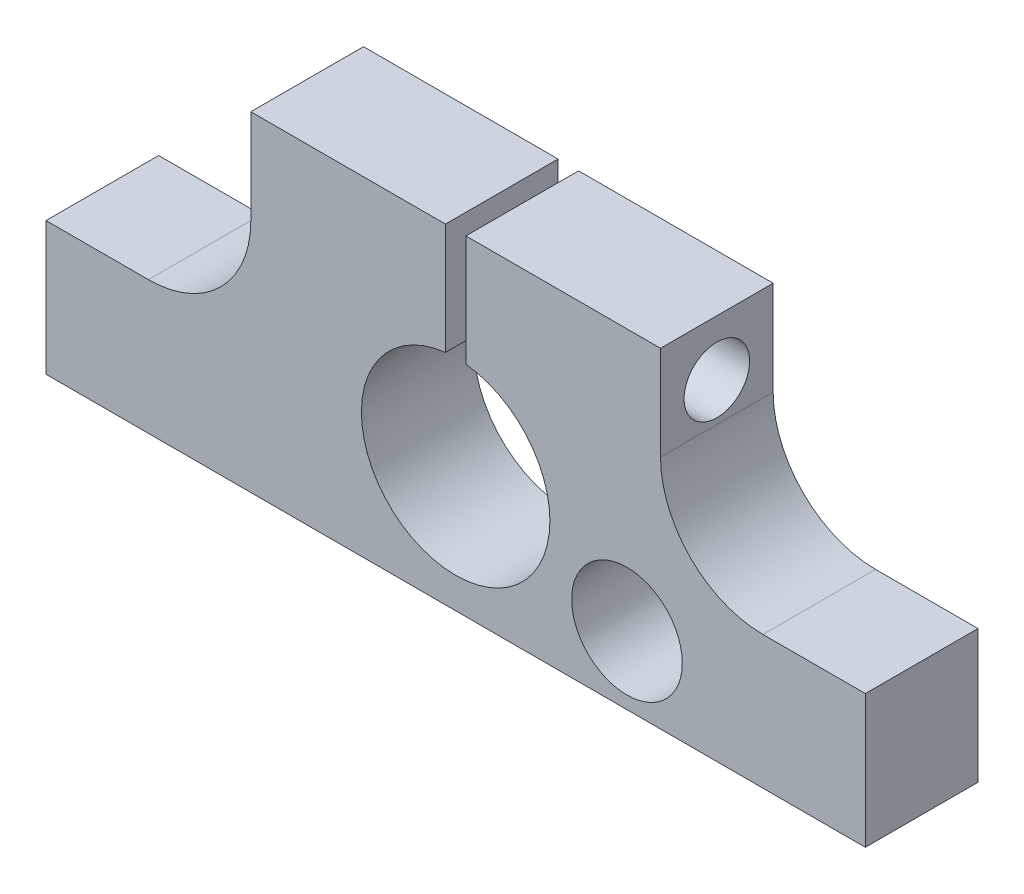
ISO-10303-21;
HEADER;
FILE_DESCRIPTION(('STEP AP214'),'2;1');
FILE_NAME('part.step','',(''),(''),'','','');
FILE_SCHEMA(('AUTOMOTIVE_DESIGN { 1 0 10303 214 1 1 1 1 }'));
ENDSEC;
DATA;
#1=APPLICATION_CONTEXT('core data for automotive mechanical design processes');
#2=APPLICATION_PROTOCOL_DEFINITION('international standard','automotive_design',2000,#1);
#3=PRODUCT_CONTEXT('',#1,'mechanical');
#4=PRODUCT('Part','Part','',(#3));
#5=PRODUCT_RELATED_PRODUCT_CATEGORY('part','',(#4));
#6=PRODUCT_DEFINITION_FORMATION('','',#4);
#7=PRODUCT_DEFINITION_CONTEXT('part definition',#1,'design');
#8=PRODUCT_DEFINITION('design','',#6,#7);
#9=PRODUCT_DEFINITION_SHAPE('','',#8);
#10=(LENGTH_UNIT() NAMED_UNIT(*) SI_UNIT(.MILLI.,.METRE.));
#11=(NAMED_UNIT(*) PLANE_ANGLE_UNIT() SI_UNIT($,.RADIAN.));
#12=(NAMED_UNIT(*) SI_UNIT($,.STERADIAN.) SOLID_ANGLE_UNIT());
#13=UNCERTAINTY_MEASURE_WITH_UNIT(LENGTH_MEASURE(1.E-05),#10,'distance_accuracy_value','');
#14=(GEOMETRIC_REPRESENTATION_CONTEXT(3) GLOBAL_UNCERTAINTY_ASSIGNED_CONTEXT((#13)) GLOBAL_UNIT_ASSIGNED_CONTEXT((#10,
#11,#12)) REPRESENTATION_CONTEXT('',''));
#15=CARTESIAN_POINT('',(0.,0.,0.));
#16=DIRECTION('',(0.,0.,1.));
#17=DIRECTION('',(1.,0.,0.));
#18=AXIS2_PLACEMENT_3D('',#15,#16,#17);
#19=CARTESIAN_POINT('',(0.5,-10.001,0.));
#20=DIRECTION('',(-1.,0.,0.));
#21=DIRECTION('',(0.,0.,1.));
#22=AXIS2_PLACEMENT_3D('',#19,#20,#21);
#23=PLANE('',#22);
#24=DIRECTION('',(0.,0.,-1.));
#25=VECTOR('',#24,1.);
#26=CARTESIAN_POINT('',(0.5,0.673569040957753,5.5));
#27=LINE('',#26,#25);
#28=CARTESIAN_POINT('',(0.5,0.673569040957753,0.));
#29=VERTEX_POINT('',#28);
#30=CARTESIAN_POINT('',(0.5,0.673569040957753,5.5));
#31=VERTEX_POINT('',#30);
#32=EDGE_CURVE('E144',#29,#31,#27,.F.);
#33=ORIENTED_EDGE('',*,*,#32,.T.);
#34=DIRECTION('',(0.,1.,0.));
#35=VECTOR('',#34,1.);
#36=CARTESIAN_POINT('',(0.5,-10.001,5.5));
#37=LINE('',#36,#35);
#38=CARTESIAN_POINT('',(0.5,6.1,5.5));
#39=VERTEX_POINT('',#38);
#40=EDGE_CURVE('E147',#31,#39,#37,.T.);
#41=ORIENTED_EDGE('',*,*,#40,.T.);
#42=DIRECTION('',(0.,0.,1.));
#43=VECTOR('',#42,1.);
#44=CARTESIAN_POINT('',(0.5,6.1,0.));
#45=LINE('',#44,#43);
#46=CARTESIAN_POINT('',(0.5,6.1,0.));
#47=VERTEX_POINT('',#46);
#48=EDGE_CURVE('E279',#47,#39,#45,.T.);
#49=ORIENTED_EDGE('',*,*,#48,.F.);
#50=DIRECTION('',(0.,1.,0.));
#51=VECTOR('',#50,1.);
#52=CARTESIAN_POINT('',(0.5,-10.001,0.));
#53=LINE('',#52,#51);
#54=EDGE_CURVE('E150',#29,#47,#53,.T.);
#55=ORIENTED_EDGE('',*,*,#54,.F.);
#56=EDGE_LOOP('',(#33,#41,#49,#55));
#57=FACE_BOUND('',#56,.T.);
#58=CARTESIAN_POINT('',(0.5,3.38678452047888,2.75));
#59=DIRECTION('',(-1.,0.,0.));
#60=DIRECTION('',(0.,0.,1.));
#61=AXIS2_PLACEMENT_3D('',#58,#59,#60);
#62=CIRCLE('',#61,1.6);
#63=CARTESIAN_POINT('',(0.5,3.38678452047888,4.35));
#64=VERTEX_POINT('',#63);
#65=EDGE_CURVE('E481',#64,#64,#62,.F.);
#66=ORIENTED_EDGE('',*,*,#65,.T.);
#67=EDGE_LOOP('',(#66));
#68=FACE_BOUND('',#67,.T.);
#69=ADVANCED_FACE('F46',(#57,#68),#23,.T.);
#70=CARTESIAN_POINT('',(0.,6.1,5.5));
#71=DIRECTION('',(0.,1.,0.));
#72=DIRECTION('',(0.,0.,1.));
#73=AXIS2_PLACEMENT_3D('',#70,#71,#72);
#74=PLANE('',#73);
#75=DIRECTION('',(1.,0.,0.));
#76=VECTOR('',#75,1.);
#77=CARTESIAN_POINT('',(0.,6.1,0.));
#78=LINE('',#77,#76);
#79=CARTESIAN_POINT('',(10.,6.1,0.));
#80=VERTEX_POINT('',#79);
#81=EDGE_CURVE('E190',#47,#80,#78,.T.);
#82=ORIENTED_EDGE('',*,*,#81,.F.);
#83=ORIENTED_EDGE('',*,*,#48,.T.);
#84=DIRECTION('',(1.,0.,0.));
#85=VECTOR('',#84,1.);
#86=CARTESIAN_POINT('',(0.,6.1,5.5));
#87=LINE('',#86,#85);
#88=CARTESIAN_POINT('',(10.,6.1,5.5));
#89=VERTEX_POINT('',#88);
#90=EDGE_CURVE('E165',#39,#89,#87,.T.);
#91=ORIENTED_EDGE('',*,*,#90,.T.);
#92=DIRECTION('',(0.,0.,-1.));
#93=VECTOR('',#92,1.);
#94=CARTESIAN_POINT('',(10.,6.1,5.5));
#95=LINE('',#94,#93);
#96=EDGE_CURVE('E209',#89,#80,#95,.T.);
#97=ORIENTED_EDGE('',*,*,#96,.T.);
#98=EDGE_LOOP('',(#82,#83,#91,#97));
#99=FACE_BOUND('',#98,.T.);
#100=ADVANCED_FACE('F277',(#99),#74,.T.);
#101=CARTESIAN_POINT('',(0.,-10.,5.5));
#102=DIRECTION('',(0.,1.,0.));
#103=DIRECTION('',(0.,0.,1.));
#104=AXIS2_PLACEMENT_3D('',#101,#102,#103);
#105=PLANE('',#104);
#106=DIRECTION('',(1.,0.,0.));
#107=VECTOR('',#106,1.);
#108=CARTESIAN_POINT('',(0.,-10.,0.));
#109=LINE('',#108,#107);
#110=CARTESIAN_POINT('',(-20.,-10.,0.));
#111=VERTEX_POINT('',#110);
#112=CARTESIAN_POINT('',(20.,-10.,0.));
#113=VERTEX_POINT('',#112);
#114=EDGE_CURVE('E155',#111,#113,#109,.T.);
#115=ORIENTED_EDGE('',*,*,#114,.T.);
#116=DIRECTION('',(0.,0.,-1.));
#117=VECTOR('',#116,1.);
#118=CARTESIAN_POINT('',(20.,-10.,5.5));
#119=LINE('',#118,#117);
#120=CARTESIAN_POINT('',(20.,-10.,5.5));
#121=VERTEX_POINT('',#120);
#122=EDGE_CURVE('E215',#121,#113,#119,.T.);
#123=ORIENTED_EDGE('',*,*,#122,.F.);
#124=DIRECTION('',(1.,0.,0.));
#125=VECTOR('',#124,1.);
#126=CARTESIAN_POINT('',(0.,-10.,5.5));
#127=LINE('',#126,#125);
#128=CARTESIAN_POINT('',(-20.,-10.,5.5));
#129=VERTEX_POINT('',#128);
#130=EDGE_CURVE('E204',#129,#121,#127,.T.);
#131=ORIENTED_EDGE('',*,*,#130,.F.);
#132=DIRECTION('',(0.,0.,-1.));
#133=VECTOR('',#132,1.);
#134=CARTESIAN_POINT('',(-20.,-10.,5.5));
#135=LINE('',#134,#133);
#136=EDGE_CURVE('E171',#129,#111,#135,.T.);
#137=ORIENTED_EDGE('',*,*,#136,.T.);
#138=EDGE_LOOP('',(#115,#123,#131,#137));
#139=FACE_BOUND('',#138,.T.);
#140=ADVANCED_FACE('F297',(#139),#105,.F.);
#141=CARTESIAN_POINT('',(20.,0.,5.5));
#142=DIRECTION('',(-1.,0.,0.));
#143=DIRECTION('',(0.,0.,1.));
#144=AXIS2_PLACEMENT_3D('',#141,#142,#143);
#145=PLANE('',#144);
#146=DIRECTION('',(0.,1.,0.));
#147=VECTOR('',#146,1.);
#148=CARTESIAN_POINT('',(20.,0.,0.));
#149=LINE('',#148,#147);
#150=CARTESIAN_POINT('',(20.,-3.5,0.));
#151=VERTEX_POINT('',#150);
#152=EDGE_CURVE('E183',#113,#151,#149,.T.);
#153=ORIENTED_EDGE('',*,*,#152,.T.);
#154=DIRECTION('',(0.,0.,-1.));
#155=VECTOR('',#154,1.);
#156=CARTESIAN_POINT('',(20.,-3.5,5.5));
#157=LINE('',#156,#155);
#158=CARTESIAN_POINT('',(20.,-3.5,5.5));
#159=VERTEX_POINT('',#158);
#160=EDGE_CURVE('E212',#159,#151,#157,.T.);
#161=ORIENTED_EDGE('',*,*,#160,.F.);
#162=DIRECTION('',(0.,1.,0.));
#163=VECTOR('',#162,1.);
#164=CARTESIAN_POINT('',(20.,0.,5.5));
#165=LINE('',#164,#163);
#166=EDGE_CURVE('E265',#121,#159,#165,.T.);
#167=ORIENTED_EDGE('',*,*,#166,.F.);
#168=ORIENTED_EDGE('',*,*,#122,.T.);
#169=EDGE_LOOP('',(#153,#161,#167,#168));
#170=FACE_BOUND('',#169,.T.);
#171=ADVANCED_FACE('F327',(#170),#145,.F.);
#172=CARTESIAN_POINT('',(0.,-3.5,5.5));
#173=DIRECTION('',(0.,1.,0.));
#174=DIRECTION('',(0.,0.,1.));
#175=AXIS2_PLACEMENT_3D('',#172,#173,#174);
#176=PLANE('',#175);
#177=DIRECTION('',(1.,0.,0.));
#178=VECTOR('',#177,1.);
#179=CARTESIAN_POINT('',(0.,-3.5,0.));
#180=LINE('',#179,#178);
#181=CARTESIAN_POINT('',(15.,-3.5,0.));
#182=VERTEX_POINT('',#181);
#183=EDGE_CURVE('E186',#182,#151,#180,.T.);
#184=ORIENTED_EDGE('',*,*,#183,.F.);
#185=DIRECTION('',(0.,0.,-1.));
#186=VECTOR('',#185,1.);
#187=CARTESIAN_POINT('',(15.,-3.5,5.5));
#188=LINE('',#187,#186);
#189=CARTESIAN_POINT('',(15.,-3.5,5.5));
#190=VERTEX_POINT('',#189);
#191=EDGE_CURVE('E61',#182,#190,#188,.F.);
#192=ORIENTED_EDGE('',*,*,#191,.T.);
#193=DIRECTION('',(1.,0.,0.));
#194=VECTOR('',#193,1.);
#195=CARTESIAN_POINT('',(0.,-3.5,5.5));
#196=LINE('',#195,#194);
#197=EDGE_CURVE('E268',#190,#159,#196,.T.);
#198=ORIENTED_EDGE('',*,*,#197,.T.);
#199=ORIENTED_EDGE('',*,*,#160,.T.);
#200=EDGE_LOOP('',(#184,#192,#198,#199));
#201=FACE_BOUND('',#200,.T.);
#202=ADVANCED_FACE('F323',(#201),#176,.T.);
#203=CARTESIAN_POINT('',(10.,0.,5.5));
#204=DIRECTION('',(1.,0.,0.));
#205=DIRECTION('',(0.,1.,0.));
#206=AXIS2_PLACEMENT_3D('',#203,#204,#205);
#207=PLANE('',#206);
#208=CARTESIAN_POINT('',(10.,3.38678452047888,2.75));
#209=DIRECTION('',(1.,0.,0.));
#210=DIRECTION('',(0.,0.,-1.));
#211=AXIS2_PLACEMENT_3D('',#208,#209,#210);
#212=CIRCLE('',#211,1.6);
#213=CARTESIAN_POINT('',(10.,3.38678452047888,1.15));
#214=VERTEX_POINT('',#213);
#215=EDGE_CURVE('E476',#214,#214,#212,.T.);
#216=ORIENTED_EDGE('',*,*,#215,.F.);
#217=EDGE_LOOP('',(#216));
#218=FACE_BOUND('',#217,.T.);
#219=DIRECTION('',(0.,-1.,0.));
#220=VECTOR('',#219,1.);
#221=CARTESIAN_POINT('',(10.,0.,5.5));
#222=LINE('',#221,#220);
#223=CARTESIAN_POINT('',(10.,1.5,5.5));
#224=VERTEX_POINT('',#223);
#225=EDGE_CURVE('E270',#89,#224,#222,.T.);
#226=ORIENTED_EDGE('',*,*,#225,.T.);
#227=DIRECTION('',(0.,0.,-1.));
#228=VECTOR('',#227,1.);
#229=CARTESIAN_POINT('',(10.,1.5,0.));
#230=LINE('',#229,#228);
#231=CARTESIAN_POINT('',(10.,1.5,0.));
#232=VERTEX_POINT('',#231);
#233=EDGE_CURVE('E223',#224,#232,#230,.T.);
#234=ORIENTED_EDGE('',*,*,#233,.T.);
#235=DIRECTION('',(0.,-1.,0.));
#236=VECTOR('',#235,1.);
#237=CARTESIAN_POINT('',(10.,0.,0.));
#238=LINE('',#237,#236);
#239=EDGE_CURVE('E188',#80,#232,#238,.T.);
#240=ORIENTED_EDGE('',*,*,#239,.F.);
#241=ORIENTED_EDGE('',*,*,#96,.F.);
#242=EDGE_LOOP('',(#226,#234,#240,#241));
#243=FACE_BOUND('',#242,.T.);
#244=ADVANCED_FACE('F281',(#218,#243),#207,.T.);
#245=DIRECTION('',(0.,0.,1.));
#246=VECTOR('',#245,1.);
#247=CARTESIAN_POINT('',(-0.5,6.1,0.));
#248=LINE('',#247,#246);
#249=CARTESIAN_POINT('',(-0.5,6.1,0.));
#250=VERTEX_POINT('',#249);
#251=CARTESIAN_POINT('',(-0.5,6.1,5.5));
#252=VERTEX_POINT('',#251);
#253=EDGE_CURVE('E166',#250,#252,#248,.T.);
#254=ORIENTED_EDGE('',*,*,#253,.F.);
#255=CARTESIAN_POINT('',(-10.,6.1,0.));
#256=VERTEX_POINT('',#255);
#257=EDGE_CURVE('E191',#256,#250,#78,.T.);
#258=ORIENTED_EDGE('',*,*,#257,.F.);
#259=DIRECTION('',(0.,0.,-1.));
#260=VECTOR('',#259,1.);
#261=CARTESIAN_POINT('',(-10.,6.1,5.5));
#262=LINE('',#261,#260);
#263=CARTESIAN_POINT('',(-10.,6.1,5.5));
#264=VERTEX_POINT('',#263);
#265=EDGE_CURVE('E207',#264,#256,#262,.T.);
#266=ORIENTED_EDGE('',*,*,#265,.F.);
#267=EDGE_CURVE('E254',#264,#252,#87,.T.);
#268=ORIENTED_EDGE('',*,*,#267,.T.);
#269=EDGE_LOOP('',(#254,#258,#266,#268));
#270=FACE_BOUND('',#269,.T.);
#271=ADVANCED_FACE('F253',(#270),#74,.T.);
#272=CARTESIAN_POINT('',(-10.,0.,5.5));
#273=DIRECTION('',(1.,0.,0.));
#274=DIRECTION('',(0.,1.,0.));
#275=AXIS2_PLACEMENT_3D('',#272,#273,#274);
#276=PLANE('',#275);
#277=CARTESIAN_POINT('',(-10.,3.38678452047888,2.75));
#278=DIRECTION('',(1.,0.,0.));
#279=DIRECTION('',(0.,1.,0.));
#280=AXIS2_PLACEMENT_3D('',#277,#278,#279);
#281=CIRCLE('',#280,1.25);
#282=CARTESIAN_POINT('',(-10.,4.63678452047887,2.75));
#283=VERTEX_POINT('',#282);
#284=EDGE_CURVE('E484',#283,#283,#281,.F.);
#285=ORIENTED_EDGE('',*,*,#284,.F.);
#286=EDGE_LOOP('',(#285));
#287=FACE_BOUND('',#286,.T.);
#288=DIRECTION('',(0.,-1.,0.));
#289=VECTOR('',#288,1.);
#290=CARTESIAN_POINT('',(-10.,0.,0.));
#291=LINE('',#290,#289);
#292=CARTESIAN_POINT('',(-10.,1.5,0.));
#293=VERTEX_POINT('',#292);
#294=EDGE_CURVE('E194',#256,#293,#291,.T.);
#295=ORIENTED_EDGE('',*,*,#294,.T.);
#296=DIRECTION('',(0.,0.,-1.));
#297=VECTOR('',#296,1.);
#298=CARTESIAN_POINT('',(-10.,1.5,5.5));
#299=LINE('',#298,#297);
#300=CARTESIAN_POINT('',(-10.,1.5,5.5));
#301=VERTEX_POINT('',#300);
#302=EDGE_CURVE('E221',#293,#301,#299,.F.);
#303=ORIENTED_EDGE('',*,*,#302,.T.);
#304=DIRECTION('',(0.,-1.,0.));
#305=VECTOR('',#304,1.);
#306=CARTESIAN_POINT('',(-10.,0.,5.5));
#307=LINE('',#306,#305);
#308=EDGE_CURVE('E237',#264,#301,#307,.T.);
#309=ORIENTED_EDGE('',*,*,#308,.F.);
#310=ORIENTED_EDGE('',*,*,#265,.T.);
#311=EDGE_LOOP('',(#295,#303,#309,#310));
#312=FACE_BOUND('',#311,.T.);
#313=ADVANCED_FACE('F249',(#287,#312),#276,.F.);
#314=CARTESIAN_POINT('',(0.,-3.5,5.5));
#315=DIRECTION('',(0.,1.,0.));
#316=DIRECTION('',(0.,0.,1.));
#317=AXIS2_PLACEMENT_3D('',#314,#315,#316);
#318=PLANE('',#317);
#319=DIRECTION('',(1.,0.,0.));
#320=VECTOR('',#319,1.);
#321=CARTESIAN_POINT('',(0.,-3.5,5.5));
#322=LINE('',#321,#320);
#323=CARTESIAN_POINT('',(-20.,-3.5,5.5));
#324=VERTEX_POINT('',#323);
#325=CARTESIAN_POINT('',(-15.,-3.5,5.5));
#326=VERTEX_POINT('',#325);
#327=EDGE_CURVE('E177',#324,#326,#322,.T.);
#328=ORIENTED_EDGE('',*,*,#327,.T.);
#329=DIRECTION('',(0.,0.,-1.));
#330=VECTOR('',#329,1.);
#331=CARTESIAN_POINT('',(-15.,-3.5,5.5));
#332=LINE('',#331,#330);
#333=CARTESIAN_POINT('',(-15.,-3.5,0.));
#334=VERTEX_POINT('',#333);
#335=EDGE_CURVE('E218',#326,#334,#332,.T.);
#336=ORIENTED_EDGE('',*,*,#335,.T.);
#337=DIRECTION('',(1.,0.,0.));
#338=VECTOR('',#337,1.);
#339=CARTESIAN_POINT('',(0.,-3.5,0.));
#340=LINE('',#339,#338);
#341=CARTESIAN_POINT('',(-20.,-3.5,0.));
#342=VERTEX_POINT('',#341);
#343=EDGE_CURVE('E197',#342,#334,#340,.T.);
#344=ORIENTED_EDGE('',*,*,#343,.F.);
#345=DIRECTION('',(0.,0.,-1.));
#346=VECTOR('',#345,1.);
#347=CARTESIAN_POINT('',(-20.,-3.5,5.5));
#348=LINE('',#347,#346);
#349=EDGE_CURVE('E174',#324,#342,#348,.T.);
#350=ORIENTED_EDGE('',*,*,#349,.F.);
#351=EDGE_LOOP('',(#328,#336,#344,#350));
#352=FACE_BOUND('',#351,.T.);
#353=ADVANCED_FACE('F242',(#352),#318,.T.);
#354=CARTESIAN_POINT('',(-20.,0.,5.5));
#355=DIRECTION('',(-1.,0.,0.));
#356=DIRECTION('',(0.,0.,1.));
#357=AXIS2_PLACEMENT_3D('',#354,#355,#356);
#358=PLANE('',#357);
#359=DIRECTION('',(0.,1.,0.));
#360=VECTOR('',#359,1.);
#361=CARTESIAN_POINT('',(-20.,0.,0.));
#362=LINE('',#361,#360);
#363=EDGE_CURVE('E200',#111,#342,#362,.T.);
#364=ORIENTED_EDGE('',*,*,#363,.F.);
#365=ORIENTED_EDGE('',*,*,#136,.F.);
#366=DIRECTION('',(0.,1.,0.));
#367=VECTOR('',#366,1.);
#368=CARTESIAN_POINT('',(-20.,0.,5.5));
#369=LINE('',#368,#367);
#370=EDGE_CURVE('E172',#129,#324,#369,.T.);
#371=ORIENTED_EDGE('',*,*,#370,.T.);
#372=ORIENTED_EDGE('',*,*,#349,.T.);
#373=EDGE_LOOP('',(#364,#365,#371,#372));
#374=FACE_BOUND('',#373,.T.);
#375=ADVANCED_FACE('F311',(#374),#358,.T.);
#376=CARTESIAN_POINT('',(0.,-3.9,5.5));
#377=DIRECTION('',(0.,0.,-1.));
#378=DIRECTION('',(-1.,0.,0.));
#379=AXIS2_PLACEMENT_3D('',#376,#377,#378);
#380=CYLINDRICAL_SURFACE('',#379,4.60081881542919);
#381=DIRECTION('',(0.,0.,-1.));
#382=VECTOR('',#381,1.);
#383=CARTESIAN_POINT('',(-0.5,0.673569040957753,5.5));
#384=LINE('',#383,#382);
#385=CARTESIAN_POINT('',(-0.5,0.673569040957753,0.));
#386=VERTEX_POINT('',#385);
#387=CARTESIAN_POINT('',(-0.5,0.673569040957753,5.5));
#388=VERTEX_POINT('',#387);
#389=EDGE_CURVE('E170',#386,#388,#384,.F.);
#390=ORIENTED_EDGE('',*,*,#389,.T.);
#391=CARTESIAN_POINT('',(0.,-3.9,5.5));
#392=DIRECTION('',(0.,0.,1.));
#393=DIRECTION('',(1.,0.,0.));
#394=AXIS2_PLACEMENT_3D('',#391,#392,#393);
#395=CIRCLE('',#394,4.60081881542919);
#396=EDGE_CURVE('E163',#388,#31,#395,.T.);
#397=ORIENTED_EDGE('',*,*,#396,.T.);
#398=ORIENTED_EDGE('',*,*,#32,.F.);
#399=CARTESIAN_POINT('',(0.,-3.9,0.));
#400=DIRECTION('',(0.,0.,1.));
#401=DIRECTION('',(1.,0.,0.));
#402=AXIS2_PLACEMENT_3D('',#399,#400,#401);
#403=CIRCLE('',#402,4.60081881542919);
#404=EDGE_CURVE('E203',#386,#29,#403,.T.);
#405=ORIENTED_EDGE('',*,*,#404,.F.);
#406=EDGE_LOOP('',(#390,#397,#398,#405));
#407=FACE_BOUND('',#406,.T.);
#408=ADVANCED_FACE('F169',(#407),#380,.F.);
#409=CARTESIAN_POINT('',(0.,0.,5.5));
#410=DIRECTION('',(0.,0.,1.));
#411=DIRECTION('',(1.,0.,0.));
#412=AXIS2_PLACEMENT_3D('',#409,#410,#411);
#413=PLANE('',#412);
#414=CARTESIAN_POINT('',(8.3631313306114,-6.6795768289154,5.5));
#415=DIRECTION('',(0.,0.,1.));
#416=DIRECTION('',(1.,0.,0.));
#417=AXIS2_PLACEMENT_3D('',#414,#415,#416);
#418=CIRCLE('',#417,2.7);
#419=CARTESIAN_POINT('',(11.0631313306114,-6.6795768289154,5.5));
#420=VERTEX_POINT('',#419);
#421=EDGE_CURVE('E474',#420,#420,#418,.T.);
#422=ORIENTED_EDGE('',*,*,#421,.F.);
#423=EDGE_LOOP('',(#422));
#424=FACE_BOUND('',#423,.T.);
#425=DIRECTION('',(0.,1.,0.));
#426=VECTOR('',#425,1.);
#427=CARTESIAN_POINT('',(-0.5,-10.001,5.5));
#428=LINE('',#427,#426);
#429=EDGE_CURVE('E156',#388,#252,#428,.T.);
#430=ORIENTED_EDGE('',*,*,#429,.T.);
#431=ORIENTED_EDGE('',*,*,#267,.F.);
#432=ORIENTED_EDGE('',*,*,#308,.T.);
#433=CARTESIAN_POINT('',(-15.,1.5,5.5));
#434=DIRECTION('',(0.,0.,1.));
#435=DIRECTION('',(1.,0.,0.));
#436=AXIS2_PLACEMENT_3D('',#433,#434,#435);
#437=CIRCLE('',#436,5.);
#438=EDGE_CURVE('E229',#301,#326,#437,.F.);
#439=ORIENTED_EDGE('',*,*,#438,.T.);
#440=ORIENTED_EDGE('',*,*,#327,.F.);
#441=ORIENTED_EDGE('',*,*,#370,.F.);
#442=ORIENTED_EDGE('',*,*,#130,.T.);
#443=ORIENTED_EDGE('',*,*,#166,.T.);
#444=ORIENTED_EDGE('',*,*,#197,.F.);
#445=CARTESIAN_POINT('',(15.,1.5,5.5));
#446=DIRECTION('',(0.,0.,1.));
#447=DIRECTION('',(1.,0.,0.));
#448=AXIS2_PLACEMENT_3D('',#445,#446,#447);
#449=CIRCLE('',#448,5.);
#450=EDGE_CURVE('E11',#190,#224,#449,.F.);
#451=ORIENTED_EDGE('',*,*,#450,.T.);
#452=ORIENTED_EDGE('',*,*,#225,.F.);
#453=ORIENTED_EDGE('',*,*,#90,.F.);
#454=ORIENTED_EDGE('',*,*,#40,.F.);
#455=ORIENTED_EDGE('',*,*,#396,.F.);
#456=EDGE_LOOP('',(#430,#431,#432,#439,#440,#441,#442,#443,#444,#451,#452,#453,#454,#455));
#457=FACE_BOUND('',#456,.T.);
#458=ADVANCED_FACE('F162',(#424,#457),#413,.T.);
#459=CARTESIAN_POINT('',(0.,0.,0.));
#460=DIRECTION('',(0.,0.,1.));
#461=DIRECTION('',(1.,0.,0.));
#462=AXIS2_PLACEMENT_3D('',#459,#460,#461);
#463=PLANE('',#462);
#464=CARTESIAN_POINT('',(8.3631313306114,-6.6795768289154,0.));
#465=DIRECTION('',(0.,0.,1.));
#466=DIRECTION('',(1.,0.,0.));
#467=AXIS2_PLACEMENT_3D('',#464,#465,#466);
#468=CIRCLE('',#467,2.7);
#469=CARTESIAN_POINT('',(11.0631313306114,-6.6795768289154,0.));
#470=VERTEX_POINT('',#469);
#471=EDGE_CURVE('E471',#470,#470,#468,.T.);
#472=ORIENTED_EDGE('',*,*,#471,.T.);
#473=EDGE_LOOP('',(#472));
#474=FACE_BOUND('',#473,.T.);
#475=ORIENTED_EDGE('',*,*,#257,.T.);
#476=DIRECTION('',(0.,1.,0.));
#477=VECTOR('',#476,1.);
#478=CARTESIAN_POINT('',(-0.5,-10.001,0.));
#479=LINE('',#478,#477);
#480=EDGE_CURVE('E256',#386,#250,#479,.T.);
#481=ORIENTED_EDGE('',*,*,#480,.F.);
#482=ORIENTED_EDGE('',*,*,#404,.T.);
#483=ORIENTED_EDGE('',*,*,#54,.T.);
#484=ORIENTED_EDGE('',*,*,#81,.T.);
#485=ORIENTED_EDGE('',*,*,#239,.T.);
#486=CARTESIAN_POINT('',(15.,1.5,0.));
#487=DIRECTION('',(0.,0.,1.));
#488=DIRECTION('',(1.,0.,0.));
#489=AXIS2_PLACEMENT_3D('',#486,#487,#488);
#490=CIRCLE('',#489,5.);
#491=EDGE_CURVE('E54',#232,#182,#490,.T.);
#492=ORIENTED_EDGE('',*,*,#491,.T.);
#493=ORIENTED_EDGE('',*,*,#183,.T.);
#494=ORIENTED_EDGE('',*,*,#152,.F.);
#495=ORIENTED_EDGE('',*,*,#114,.F.);
#496=ORIENTED_EDGE('',*,*,#363,.T.);
#497=ORIENTED_EDGE('',*,*,#343,.T.);
#498=CARTESIAN_POINT('',(-15.,1.5,0.));
#499=DIRECTION('',(0.,0.,1.));
#500=DIRECTION('',(1.,0.,0.));
#501=AXIS2_PLACEMENT_3D('',#498,#499,#500);
#502=CIRCLE('',#501,5.);
#503=EDGE_CURVE('E227',#334,#293,#502,.T.);
#504=ORIENTED_EDGE('',*,*,#503,.T.);
#505=ORIENTED_EDGE('',*,*,#294,.F.);
#506=EDGE_LOOP('',(#475,#481,#482,#483,#484,#485,#492,#493,#494,#495,#496,#497,#504,#505));
#507=FACE_BOUND('',#506,.T.);
#508=ADVANCED_FACE('F246',(#474,#507),#463,.F.);
#509=CARTESIAN_POINT('',(-0.5,-10.001,0.));
#510=DIRECTION('',(-1.,0.,0.));
#511=DIRECTION('',(0.,0.,1.));
#512=AXIS2_PLACEMENT_3D('',#509,#510,#511);
#513=PLANE('',#512);
#514=CARTESIAN_POINT('',(-0.499999999999999,3.38678452047888,2.75));
#515=DIRECTION('',(-1.,0.,0.));
#516=DIRECTION('',(0.,0.,1.));
#517=AXIS2_PLACEMENT_3D('',#514,#515,#516);
#518=CIRCLE('',#517,1.25);
#519=CARTESIAN_POINT('',(-0.499999999999999,3.38678452047888,4.));
#520=VERTEX_POINT('',#519);
#521=EDGE_CURVE('E487',#520,#520,#518,.T.);
#522=ORIENTED_EDGE('',*,*,#521,.T.);
#523=EDGE_LOOP('',(#522));
#524=FACE_BOUND('',#523,.T.);
#525=ORIENTED_EDGE('',*,*,#480,.T.);
#526=ORIENTED_EDGE('',*,*,#253,.T.);
#527=ORIENTED_EDGE('',*,*,#429,.F.);
#528=ORIENTED_EDGE('',*,*,#389,.F.);
#529=EDGE_LOOP('',(#525,#526,#527,#528));
#530=FACE_BOUND('',#529,.T.);
#531=ADVANCED_FACE('F301',(#524,#530),#513,.F.);
#532=CARTESIAN_POINT('',(10.,3.38678452047888,2.75));
#533=DIRECTION('',(1.,0.,0.));
#534=DIRECTION('',(0.,0.,-1.));
#535=AXIS2_PLACEMENT_3D('',#532,#533,#534);
#536=CYLINDRICAL_SURFACE('',#535,1.25);
#537=ORIENTED_EDGE('',*,*,#284,.T.);
#538=EDGE_LOOP('',(#537));
#539=FACE_BOUND('',#538,.T.);
#540=ORIENTED_EDGE('',*,*,#521,.F.);
#541=EDGE_LOOP('',(#540));
#542=FACE_BOUND('',#541,.T.);
#543=ADVANCED_FACE('F419',(#539,#542),#536,.F.);
#544=CARTESIAN_POINT('',(10.,3.38678452047888,2.75));
#545=DIRECTION('',(1.,0.,0.));
#546=DIRECTION('',(0.,0.,-1.));
#547=AXIS2_PLACEMENT_3D('',#544,#545,#546);
#548=CYLINDRICAL_SURFACE('',#547,1.6);
#549=ORIENTED_EDGE('',*,*,#65,.F.);
#550=EDGE_LOOP('',(#549));
#551=FACE_BOUND('',#550,.T.);
#552=ORIENTED_EDGE('',*,*,#215,.T.);
#553=EDGE_LOOP('',(#552));
#554=FACE_BOUND('',#553,.T.);
#555=ADVANCED_FACE('F426',(#551,#554),#548,.F.);
#556=CARTESIAN_POINT('',(8.3631313306114,-6.6795768289154,0.));
#557=DIRECTION('',(0.,0.,1.));
#558=DIRECTION('',(1.,0.,0.));
#559=AXIS2_PLACEMENT_3D('',#556,#557,#558);
#560=CYLINDRICAL_SURFACE('',#559,2.7);
#561=ORIENTED_EDGE('',*,*,#471,.F.);
#562=EDGE_LOOP('',(#561));
#563=FACE_BOUND('',#562,.T.);
#564=ORIENTED_EDGE('',*,*,#421,.T.);
#565=EDGE_LOOP('',(#564));
#566=FACE_BOUND('',#565,.T.);
#567=ADVANCED_FACE('F289',(#563,#566),#560,.F.);
#568=CARTESIAN_POINT('',(-15.,1.5,5.5));
#569=DIRECTION('',(0.,0.,-1.));
#570=DIRECTION('',(-1.,0.,0.));
#571=AXIS2_PLACEMENT_3D('',#568,#569,#570);
#572=CYLINDRICAL_SURFACE('',#571,5.);
#573=ORIENTED_EDGE('',*,*,#438,.F.);
#574=ORIENTED_EDGE('',*,*,#302,.F.);
#575=ORIENTED_EDGE('',*,*,#503,.F.);
#576=ORIENTED_EDGE('',*,*,#335,.F.);
#577=EDGE_LOOP('',(#573,#574,#575,#576));
#578=FACE_BOUND('',#577,.T.);
#579=ADVANCED_FACE('F244',(#578),#572,.F.);
#580=CARTESIAN_POINT('',(15.,1.5,5.5));
#581=DIRECTION('',(0.,0.,1.));
#582=DIRECTION('',(1.,0.,0.));
#583=AXIS2_PLACEMENT_3D('',#580,#581,#582);
#584=CYLINDRICAL_SURFACE('',#583,5.);
#585=ORIENTED_EDGE('',*,*,#450,.F.);
#586=ORIENTED_EDGE('',*,*,#191,.F.);
#587=ORIENTED_EDGE('',*,*,#491,.F.);
#588=ORIENTED_EDGE('',*,*,#233,.F.);
#589=EDGE_LOOP('',(#585,#586,#587,#588));
#590=FACE_BOUND('',#589,.T.);
#591=ADVANCED_FACE('F48',(#590),#584,.F.);
#592=CLOSED_SHELL('',(#69,#100,#140,#171,#202,#244,#271,#313,#353,#375,#408,#458,#508,#531,#543,
#555,#567,#579,#591));
#593=MANIFOLD_SOLID_BREP('B2',#592);
#594=ADVANCED_BREP_SHAPE_REPRESENTATION('',(#18,#593),#14);
#595=SHAPE_DEFINITION_REPRESENTATION(#9,#594);
ENDSEC;
END-ISO-10303-21;
